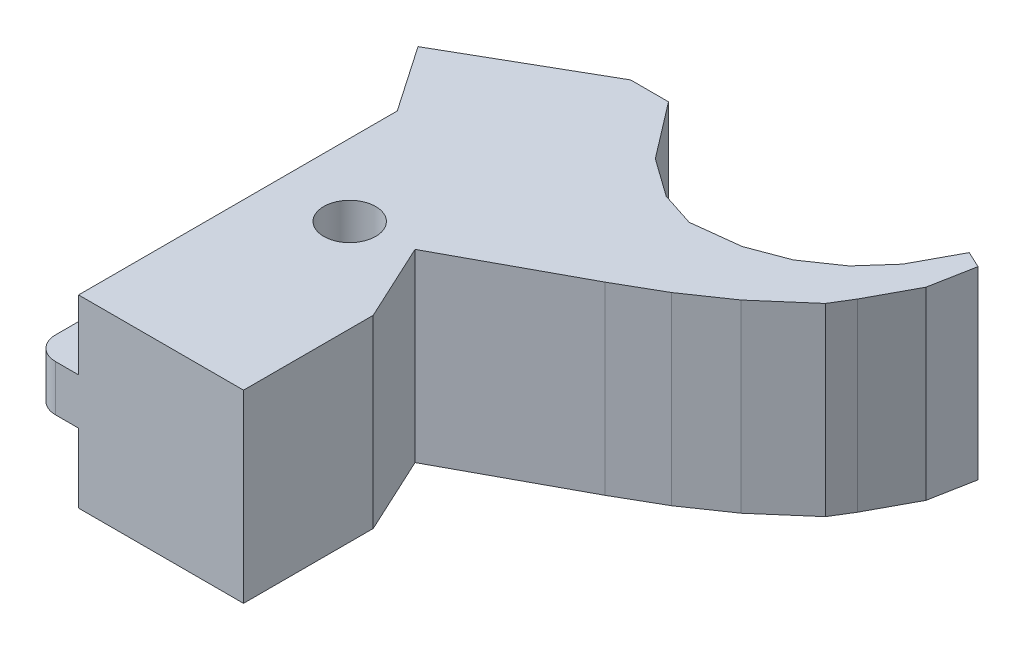
ISO-10303-21;
HEADER;
FILE_DESCRIPTION(('STEP AP214'),'2;1');
FILE_NAME('part.step','',(''),(''),'','','');
FILE_SCHEMA(('AUTOMOTIVE_DESIGN { 1 0 10303 214 1 1 1 1 }'));
ENDSEC;
DATA;
#1=APPLICATION_CONTEXT('core data for automotive mechanical design processes');
#2=APPLICATION_PROTOCOL_DEFINITION('international standard','automotive_design',2000,#1);
#3=PRODUCT_CONTEXT('',#1,'mechanical');
#4=PRODUCT('Part','Part','',(#3));
#5=PRODUCT_RELATED_PRODUCT_CATEGORY('part','',(#4));
#6=PRODUCT_DEFINITION_FORMATION('','',#4);
#7=PRODUCT_DEFINITION_CONTEXT('part definition',#1,'design');
#8=PRODUCT_DEFINITION('design','',#6,#7);
#9=PRODUCT_DEFINITION_SHAPE('','',#8);
#10=(LENGTH_UNIT() NAMED_UNIT(*) SI_UNIT(.MILLI.,.METRE.));
#11=(NAMED_UNIT(*) PLANE_ANGLE_UNIT() SI_UNIT($,.RADIAN.));
#12=(NAMED_UNIT(*) SI_UNIT($,.STERADIAN.) SOLID_ANGLE_UNIT());
#13=UNCERTAINTY_MEASURE_WITH_UNIT(LENGTH_MEASURE(1.E-05),#10,'distance_accuracy_value','');
#14=(GEOMETRIC_REPRESENTATION_CONTEXT(3) GLOBAL_UNCERTAINTY_ASSIGNED_CONTEXT((#13)) GLOBAL_UNIT_ASSIGNED_CONTEXT((#10,
#11,#12)) REPRESENTATION_CONTEXT('',''));
#15=CARTESIAN_POINT('',(0.,0.,0.));
#16=DIRECTION('',(0.,0.,1.));
#17=DIRECTION('',(1.,0.,0.));
#18=AXIS2_PLACEMENT_3D('',#15,#16,#17);
#19=CARTESIAN_POINT('',(-4.,0.,0.));
#20=DIRECTION('',(1.,0.,0.));
#21=DIRECTION('',(0.,0.,-1.));
#22=AXIS2_PLACEMENT_3D('',#19,#20,#21);
#23=PLANE('',#22);
#24=DIRECTION('',(0.,1.,0.));
#25=VECTOR('',#24,1.);
#26=CARTESIAN_POINT('',(-4.,4.00000000000001,-2.));
#27=LINE('',#26,#25);
#28=CARTESIAN_POINT('',(-4.,10.,-2.00000000000001));
#29=VERTEX_POINT('',#28);
#30=CARTESIAN_POINT('',(-4.,6.,-2.00000000000001));
#31=VERTEX_POINT('',#30);
#32=EDGE_CURVE('E41',#29,#31,#27,.F.);
#33=ORIENTED_EDGE('',*,*,#32,.F.);
#34=DIRECTION('',(0.,0.,1.));
#35=VECTOR('',#34,1.);
#36=CARTESIAN_POINT('',(-4.,10.,-8.));
#37=LINE('',#36,#35);
#38=CARTESIAN_POINT('',(-4.,10.,-8.));
#39=VERTEX_POINT('',#38);
#40=EDGE_CURVE('E455',#39,#29,#37,.T.);
#41=ORIENTED_EDGE('',*,*,#40,.F.);
#42=DIRECTION('',(0.,-1.,0.));
#43=VECTOR('',#42,1.);
#44=CARTESIAN_POINT('',(-4.,10.,-8.));
#45=LINE('',#44,#43);
#46=CARTESIAN_POINT('',(-4.,6.,-8.));
#47=VERTEX_POINT('',#46);
#48=EDGE_CURVE('E260',#39,#47,#45,.T.);
#49=ORIENTED_EDGE('',*,*,#48,.T.);
#50=DIRECTION('',(0.,0.,1.));
#51=VECTOR('',#50,1.);
#52=CARTESIAN_POINT('',(-4.,6.,-8.));
#53=LINE('',#52,#51);
#54=EDGE_CURVE('E451',#47,#31,#53,.T.);
#55=ORIENTED_EDGE('',*,*,#54,.T.);
#56=EDGE_LOOP('',(#33,#41,#49,#55));
#57=FACE_BOUND('',#56,.T.);
#58=ADVANCED_FACE('F33',(#57),#23,.F.);
#59=CARTESIAN_POINT('',(0.,16.,0.));
#60=DIRECTION('',(1.,0.,0.));
#61=DIRECTION('',(0.,0.,-1.));
#62=AXIS2_PLACEMENT_3D('',#59,#60,#61);
#63=PLANE('',#62);
#64=DIRECTION('',(0.,0.,1.));
#65=VECTOR('',#64,1.);
#66=CARTESIAN_POINT('',(0.,6.,-8.));
#67=LINE('',#66,#65);
#68=CARTESIAN_POINT('',(0.,6.,-4.45086661432432));
#69=VERTEX_POINT('',#68);
#70=CARTESIAN_POINT('',(0.,6.,0.));
#71=VERTEX_POINT('',#70);
#72=EDGE_CURVE('E460',#69,#71,#67,.T.);
#73=ORIENTED_EDGE('',*,*,#72,.F.);
#74=DIRECTION('',(0.,1.,0.));
#75=VECTOR('',#74,1.);
#76=CARTESIAN_POINT('',(0.,4.00000000000001,-4.45086661432432));
#77=LINE('',#76,#75);
#78=CARTESIAN_POINT('',(0.,10.,-4.45086661432432));
#79=VERTEX_POINT('',#78);
#80=EDGE_CURVE('E453',#69,#79,#77,.T.);
#81=ORIENTED_EDGE('',*,*,#80,.T.);
#82=DIRECTION('',(0.,0.,1.));
#83=VECTOR('',#82,1.);
#84=CARTESIAN_POINT('',(0.,10.,-8.));
#85=LINE('',#84,#83);
#86=CARTESIAN_POINT('',(0.,10.,0.));
#87=VERTEX_POINT('',#86);
#88=EDGE_CURVE('E456',#79,#87,#85,.T.);
#89=ORIENTED_EDGE('',*,*,#88,.T.);
#90=DIRECTION('',(0.,-1.,0.));
#91=VECTOR('',#90,1.);
#92=CARTESIAN_POINT('',(0.,16.,0.));
#93=LINE('',#92,#91);
#94=CARTESIAN_POINT('',(0.,16.,0.));
#95=VERTEX_POINT('',#94);
#96=EDGE_CURVE('E438',#95,#87,#93,.T.);
#97=ORIENTED_EDGE('',*,*,#96,.F.);
#98=DIRECTION('',(0.,0.,1.));
#99=VECTOR('',#98,1.);
#100=CARTESIAN_POINT('',(0.,16.,0.));
#101=LINE('',#100,#99);
#102=CARTESIAN_POINT('',(0.,16.,-27.612650648618));
#103=VERTEX_POINT('',#102);
#104=EDGE_CURVE('E278',#103,#95,#101,.T.);
#105=ORIENTED_EDGE('',*,*,#104,.F.);
#106=DIRECTION('',(0.,-1.,0.));
#107=VECTOR('',#106,1.);
#108=CARTESIAN_POINT('',(0.,16.,-27.612650648618));
#109=LINE('',#108,#107);
#110=CARTESIAN_POINT('',(0.,0.,-27.612650648618));
#111=VERTEX_POINT('',#110);
#112=EDGE_CURVE('E326',#103,#111,#109,.T.);
#113=ORIENTED_EDGE('',*,*,#112,.T.);
#114=DIRECTION('',(0.,0.,1.));
#115=VECTOR('',#114,1.);
#116=CARTESIAN_POINT('',(0.,0.,0.));
#117=LINE('',#116,#115);
#118=CARTESIAN_POINT('',(0.,0.,0.));
#119=VERTEX_POINT('',#118);
#120=EDGE_CURVE('E275',#111,#119,#117,.T.);
#121=ORIENTED_EDGE('',*,*,#120,.T.);
#122=EDGE_CURVE('E437',#71,#119,#93,.T.);
#123=ORIENTED_EDGE('',*,*,#122,.F.);
#124=EDGE_LOOP('',(#73,#81,#89,#97,#105,#113,#121,#123));
#125=FACE_BOUND('',#124,.T.);
#126=ADVANCED_FACE('F35',(#125),#63,.F.);
#127=CARTESIAN_POINT('',(0.,16.,0.));
#128=DIRECTION('',(0.,-1.,0.));
#129=DIRECTION('',(0.,0.,-1.));
#130=AXIS2_PLACEMENT_3D('',#127,#128,#129);
#131=PLANE('',#130);
#132=ORIENTED_EDGE('',*,*,#104,.T.);
#133=DIRECTION('',(1.,0.,0.));
#134=VECTOR('',#133,1.);
#135=CARTESIAN_POINT('',(0.,16.,0.));
#136=LINE('',#135,#134);
#137=CARTESIAN_POINT('',(14.2923466730162,16.,0.));
#138=VERTEX_POINT('',#137);
#139=EDGE_CURVE('E281',#95,#138,#136,.T.);
#140=ORIENTED_EDGE('',*,*,#139,.T.);
#141=DIRECTION('',(0.,0.,-1.));
#142=VECTOR('',#141,1.);
#143=CARTESIAN_POINT('',(14.2923466730162,16.,0.));
#144=LINE('',#143,#142);
#145=CARTESIAN_POINT('',(14.2923466730162,16.,-11.2386097915875));
#146=VERTEX_POINT('',#145);
#147=EDGE_CURVE('E284',#138,#146,#144,.T.);
#148=ORIENTED_EDGE('',*,*,#147,.T.);
#149=DIRECTION('',(-0.421036676412518,0.,-0.907043613678802));
#150=VECTOR('',#149,1.);
#151=CARTESIAN_POINT('',(14.2923466730162,16.,-11.2386097915875));
#152=LINE('',#151,#150);
#153=CARTESIAN_POINT('',(11.156143946173,16.,-17.9949633682485));
#154=VERTEX_POINT('',#153);
#155=EDGE_CURVE('E286',#146,#154,#152,.T.);
#156=ORIENTED_EDGE('',*,*,#155,.T.);
#157=DIRECTION('',(0.879833369481706,0.,-0.475282276070197));
#158=VECTOR('',#157,1.);
#159=CARTESIAN_POINT('',(21.8356423336241,16.,-23.7639833633253));
#160=LINE('',#159,#158);
#161=CARTESIAN_POINT('',(21.8356423336241,16.,-23.7639833633253));
#162=VERTEX_POINT('',#161);
#163=EDGE_CURVE('E288',#154,#162,#160,.T.);
#164=ORIENTED_EDGE('',*,*,#163,.T.);
#165=DIRECTION('',(0.867536104388164,0.,-0.497374212824719));
#166=VECTOR('',#165,1.);
#167=CARTESIAN_POINT('',(25.5178091544874,16.,-25.8750365111453));
#168=LINE('',#167,#166);
#169=CARTESIAN_POINT('',(25.5178091544874,16.,-25.8750365111453));
#170=VERTEX_POINT('',#169);
#171=EDGE_CURVE('E290',#162,#170,#168,.T.);
#172=ORIENTED_EDGE('',*,*,#171,.T.);
#173=DIRECTION('',(0.824555386413117,0.,-0.565781242828989));
#174=VECTOR('',#173,1.);
#175=CARTESIAN_POINT('',(29.0852326361488,16.,-28.3228784929094));
#176=LINE('',#175,#174);
#177=CARTESIAN_POINT('',(29.0852326361488,16.,-28.3228784929094));
#178=VERTEX_POINT('',#177);
#179=EDGE_CURVE('E292',#170,#178,#176,.T.);
#180=ORIENTED_EDGE('',*,*,#179,.T.);
#181=DIRECTION('',(0.755316274404742,0.,-0.655360454726512));
#182=VECTOR('',#181,1.);
#183=CARTESIAN_POINT('',(32.9900829470661,16.,-31.7109750587069));
#184=LINE('',#183,#182);
#185=CARTESIAN_POINT('',(32.9900829470661,16.,-31.7109750587069));
#186=VERTEX_POINT('',#185);
#187=EDGE_CURVE('E294',#178,#186,#184,.T.);
#188=ORIENTED_EDGE('',*,*,#187,.T.);
#189=DIRECTION('',(0.523555652741695,0.,-0.851991477939902));
#190=VECTOR('',#189,1.);
#191=CARTESIAN_POINT('',(34.0491127189331,16.,-33.4343531481045));
#192=LINE('',#191,#190);
#193=CARTESIAN_POINT('',(34.0491127189331,16.,-33.4343531481045));
#194=VERTEX_POINT('',#193);
#195=EDGE_CURVE('E296',#186,#194,#192,.T.);
#196=ORIENTED_EDGE('',*,*,#195,.T.);
#197=DIRECTION('',(0.474087368672936,0.,-0.88047780600352));
#198=VECTOR('',#197,1.);
#199=CARTESIAN_POINT('',(36.1264723932179,16.,-37.2924375628285));
#200=LINE('',#199,#198);
#201=CARTESIAN_POINT('',(36.1264723932179,16.,-37.2924375628285));
#202=VERTEX_POINT('',#201);
#203=EDGE_CURVE('E298',#194,#202,#200,.T.);
#204=ORIENTED_EDGE('',*,*,#203,.T.);
#205=DIRECTION('',(0.185606774758074,0.,-0.982624101660399));
#206=VECTOR('',#205,1.);
#207=CARTESIAN_POINT('',(36.8433222228432,16.,-41.0875248961389));
#208=LINE('',#207,#206);
#209=CARTESIAN_POINT('',(36.8433222228432,16.,-41.0875248961389));
#210=VERTEX_POINT('',#209);
#211=EDGE_CURVE('E300',#202,#210,#208,.T.);
#212=ORIENTED_EDGE('',*,*,#211,.T.);
#213=DIRECTION('',(-0.904818702200994,0.,-0.425797036329879));
#214=VECTOR('',#213,1.);
#215=CARTESIAN_POINT('',(35.4096225635926,16.,-41.7622070887275));
#216=LINE('',#215,#214);
#217=CARTESIAN_POINT('',(35.4096225635926,16.,-41.7622070887275));
#218=VERTEX_POINT('',#217);
#219=EDGE_CURVE('E302',#210,#218,#216,.T.);
#220=ORIENTED_EDGE('',*,*,#219,.T.);
#221=DIRECTION('',(-0.474087368672937,0.,0.880477806003519));
#222=VECTOR('',#221,1.);
#223=CARTESIAN_POINT('',(33.3859189346634,16.,-38.0037729920995));
#224=LINE('',#223,#222);
#225=CARTESIAN_POINT('',(33.3859189346634,16.,-38.0037729920995));
#226=VERTEX_POINT('',#225);
#227=EDGE_CURVE('E304',#218,#226,#224,.T.);
#228=ORIENTED_EDGE('',*,*,#227,.T.);
#229=DIRECTION('',(-0.664736716431069,0.,0.747077705348273));
#230=VECTOR('',#229,1.);
#231=CARTESIAN_POINT('',(31.215394459633,16.,-35.564385481035));
#232=LINE('',#231,#230);
#233=CARTESIAN_POINT('',(31.215394459633,16.,-35.564385481035));
#234=VERTEX_POINT('',#233);
#235=EDGE_CURVE('E306',#226,#234,#232,.T.);
#236=ORIENTED_EDGE('',*,*,#235,.T.);
#237=DIRECTION('',(-0.824555386413117,0.,0.565781242828989));
#238=VECTOR('',#237,1.);
#239=CARTESIAN_POINT('',(28.3448446356475,16.,-33.5947139783334));
#240=LINE('',#239,#238);
#241=CARTESIAN_POINT('',(28.3448446356475,16.,-33.5947139783334));
#242=VERTEX_POINT('',#241);
#243=EDGE_CURVE('E308',#234,#242,#240,.T.);
#244=ORIENTED_EDGE('',*,*,#243,.T.);
#245=DIRECTION('',(-0.936409540785771,0.,0.350909065037342));
#246=VECTOR('',#245,1.);
#247=CARTESIAN_POINT('',(25.1092726517162,16.,-32.3822193482706));
#248=LINE('',#247,#246);
#249=CARTESIAN_POINT('',(25.1092726517162,16.,-32.3822193482706));
#250=VERTEX_POINT('',#249);
#251=EDGE_CURVE('E310',#242,#250,#248,.T.);
#252=ORIENTED_EDGE('',*,*,#251,.T.);
#253=DIRECTION('',(-0.993215047692517,0.,0.116292171005412));
#254=VECTOR('',#253,1.);
#255=CARTESIAN_POINT('',(21.0021220020857,16.,-31.9013270512786));
#256=LINE('',#255,#254);
#257=CARTESIAN_POINT('',(21.0021220020857,16.,-31.9013270512786));
#258=VERTEX_POINT('',#257);
#259=EDGE_CURVE('E312',#250,#258,#256,.T.);
#260=ORIENTED_EDGE('',*,*,#259,.T.);
#261=DIRECTION('',(-0.950748934671646,0.,-0.309962035128062));
#262=VECTOR('',#261,1.);
#263=CARTESIAN_POINT('',(18.052032718616,16.,-32.8631116452625));
#264=LINE('',#263,#262);
#265=CARTESIAN_POINT('',(18.052032718616,16.,-32.8631116452625));
#266=VERTEX_POINT('',#265);
#267=EDGE_CURVE('E314',#258,#266,#264,.T.);
#268=ORIENTED_EDGE('',*,*,#267,.T.);
#269=DIRECTION('',(-0.81435299533713,0.,-0.580369881183925));
#270=VECTOR('',#269,1.);
#271=CARTESIAN_POINT('',(14.7690179987671,16.,-35.2028376287041));
#272=LINE('',#271,#270);
#273=CARTESIAN_POINT('',(14.7690179987671,16.,-35.2028376287041));
#274=VERTEX_POINT('',#273);
#275=EDGE_CURVE('E316',#266,#274,#272,.T.);
#276=ORIENTED_EDGE('',*,*,#275,.T.);
#277=DIRECTION('',(-0.607393028115595,0.,-0.794401478722546));
#278=VECTOR('',#277,1.);
#279=CARTESIAN_POINT('',(11.0636057691116,16.,-40.049098317022));
#280=LINE('',#279,#278);
#281=CARTESIAN_POINT('',(11.0636057691116,16.,-40.049098317022));
#282=VERTEX_POINT('',#281);
#283=EDGE_CURVE('E318',#274,#282,#280,.T.);
#284=ORIENTED_EDGE('',*,*,#283,.T.);
#285=DIRECTION('',(-1.,0.,0.));
#286=VECTOR('',#285,1.);
#287=CARTESIAN_POINT('',(7.77991108283393,16.,-40.049098317022));
#288=LINE('',#287,#286);
#289=CARTESIAN_POINT('',(7.77991108283393,16.,-40.049098317022));
#290=VERTEX_POINT('',#289);
#291=EDGE_CURVE('E320',#282,#290,#288,.T.);
#292=ORIENTED_EDGE('',*,*,#291,.T.);
#293=DIRECTION('',(-0.867536104388164,0.,0.497374212824719));
#294=VECTOR('',#293,1.);
#295=CARTESIAN_POINT('',(-3.92776405159495,16.,-33.336875419854));
#296=LINE('',#295,#294);
#297=CARTESIAN_POINT('',(-3.92776405159495,16.,-33.336875419854));
#298=VERTEX_POINT('',#297);
#299=EDGE_CURVE('E322',#290,#298,#296,.T.);
#300=ORIENTED_EDGE('',*,*,#299,.T.);
#301=DIRECTION('',(0.565781242828988,0.,0.824555386413117));
#302=VECTOR('',#301,1.);
#303=CARTESIAN_POINT('',(0.,16.,-27.612650648618));
#304=LINE('',#303,#302);
#305=EDGE_CURVE('E324',#298,#103,#304,.T.);
#306=ORIENTED_EDGE('',*,*,#305,.T.);
#307=EDGE_LOOP('',(#132,#140,#148,#156,#164,#172,#180,#188,#196,#204,#212,#220,#228,#236,#244,
#252,#260,#268,#276,#284,#292,#300,#306));
#308=FACE_BOUND('',#307,.T.);
#309=CARTESIAN_POINT('',(6.23417854950036,16.,-17.258888852138));
#310=DIRECTION('',(0.,1.,0.));
#311=DIRECTION('',(0.,0.,1.));
#312=AXIS2_PLACEMENT_3D('',#309,#310,#311);
#313=CIRCLE('',#312,2.25);
#314=CARTESIAN_POINT('',(6.23417854950036,16.,-15.008888852138));
#315=VERTEX_POINT('',#314);
#316=EDGE_CURVE('E272',#315,#315,#313,.T.);
#317=ORIENTED_EDGE('',*,*,#316,.F.);
#318=EDGE_LOOP('',(#317));
#319=FACE_BOUND('',#318,.T.);
#320=ADVANCED_FACE('F524',(#308,#319),#131,.F.);
#321=CARTESIAN_POINT('',(0.,0.,0.));
#322=DIRECTION('',(0.,-1.,0.));
#323=DIRECTION('',(0.,0.,-1.));
#324=AXIS2_PLACEMENT_3D('',#321,#322,#323);
#325=PLANE('',#324);
#326=ORIENTED_EDGE('',*,*,#120,.F.);
#327=DIRECTION('',(0.565781242828988,0.,0.824555386413117));
#328=VECTOR('',#327,1.);
#329=CARTESIAN_POINT('',(0.,0.,-27.612650648618));
#330=LINE('',#329,#328);
#331=CARTESIAN_POINT('',(-3.92776405159495,0.,-33.336875419854));
#332=VERTEX_POINT('',#331);
#333=EDGE_CURVE('E282',#332,#111,#330,.T.);
#334=ORIENTED_EDGE('',*,*,#333,.F.);
#335=DIRECTION('',(-0.867536104388164,0.,0.497374212824719));
#336=VECTOR('',#335,1.);
#337=CARTESIAN_POINT('',(-3.92776405159495,0.,-33.336875419854));
#338=LINE('',#337,#336);
#339=CARTESIAN_POINT('',(7.77991108283393,0.,-40.049098317022));
#340=VERTEX_POINT('',#339);
#341=EDGE_CURVE('E369',#340,#332,#338,.T.);
#342=ORIENTED_EDGE('',*,*,#341,.F.);
#343=DIRECTION('',(-1.,0.,0.));
#344=VECTOR('',#343,1.);
#345=CARTESIAN_POINT('',(7.77991108283393,0.,-40.049098317022));
#346=LINE('',#345,#344);
#347=CARTESIAN_POINT('',(11.0636057691116,0.,-40.049098317022));
#348=VERTEX_POINT('',#347);
#349=EDGE_CURVE('E367',#348,#340,#346,.T.);
#350=ORIENTED_EDGE('',*,*,#349,.F.);
#351=DIRECTION('',(-0.607393028115595,0.,-0.794401478722546));
#352=VECTOR('',#351,1.);
#353=CARTESIAN_POINT('',(11.0636057691116,0.,-40.049098317022));
#354=LINE('',#353,#352);
#355=CARTESIAN_POINT('',(14.7690179987671,0.,-35.2028376287041));
#356=VERTEX_POINT('',#355);
#357=EDGE_CURVE('E365',#356,#348,#354,.T.);
#358=ORIENTED_EDGE('',*,*,#357,.F.);
#359=DIRECTION('',(-0.81435299533713,0.,-0.580369881183925));
#360=VECTOR('',#359,1.);
#361=CARTESIAN_POINT('',(14.7690179987671,0.,-35.2028376287041));
#362=LINE('',#361,#360);
#363=CARTESIAN_POINT('',(18.052032718616,0.,-32.8631116452625));
#364=VERTEX_POINT('',#363);
#365=EDGE_CURVE('E363',#364,#356,#362,.T.);
#366=ORIENTED_EDGE('',*,*,#365,.F.);
#367=DIRECTION('',(-0.950748934671646,0.,-0.309962035128062));
#368=VECTOR('',#367,1.);
#369=CARTESIAN_POINT('',(18.052032718616,0.,-32.8631116452625));
#370=LINE('',#369,#368);
#371=CARTESIAN_POINT('',(21.0021220020857,0.,-31.9013270512786));
#372=VERTEX_POINT('',#371);
#373=EDGE_CURVE('E361',#372,#364,#370,.T.);
#374=ORIENTED_EDGE('',*,*,#373,.F.);
#375=DIRECTION('',(-0.993215047692517,0.,0.116292171005412));
#376=VECTOR('',#375,1.);
#377=CARTESIAN_POINT('',(21.0021220020857,0.,-31.9013270512786));
#378=LINE('',#377,#376);
#379=CARTESIAN_POINT('',(25.1092726517162,0.,-32.3822193482706));
#380=VERTEX_POINT('',#379);
#381=EDGE_CURVE('E359',#380,#372,#378,.T.);
#382=ORIENTED_EDGE('',*,*,#381,.F.);
#383=DIRECTION('',(-0.936409540785771,0.,0.350909065037342));
#384=VECTOR('',#383,1.);
#385=CARTESIAN_POINT('',(25.1092726517162,0.,-32.3822193482706));
#386=LINE('',#385,#384);
#387=CARTESIAN_POINT('',(28.3448446356475,0.,-33.5947139783334));
#388=VERTEX_POINT('',#387);
#389=EDGE_CURVE('E357',#388,#380,#386,.T.);
#390=ORIENTED_EDGE('',*,*,#389,.F.);
#391=DIRECTION('',(-0.824555386413117,0.,0.565781242828989));
#392=VECTOR('',#391,1.);
#393=CARTESIAN_POINT('',(28.3448446356475,0.,-33.5947139783334));
#394=LINE('',#393,#392);
#395=CARTESIAN_POINT('',(31.215394459633,0.,-35.564385481035));
#396=VERTEX_POINT('',#395);
#397=EDGE_CURVE('E355',#396,#388,#394,.T.);
#398=ORIENTED_EDGE('',*,*,#397,.F.);
#399=DIRECTION('',(-0.664736716431069,0.,0.747077705348273));
#400=VECTOR('',#399,1.);
#401=CARTESIAN_POINT('',(31.215394459633,0.,-35.564385481035));
#402=LINE('',#401,#400);
#403=CARTESIAN_POINT('',(33.3859189346634,0.,-38.0037729920995));
#404=VERTEX_POINT('',#403);
#405=EDGE_CURVE('E353',#404,#396,#402,.T.);
#406=ORIENTED_EDGE('',*,*,#405,.F.);
#407=DIRECTION('',(-0.474087368672937,0.,0.880477806003519));
#408=VECTOR('',#407,1.);
#409=CARTESIAN_POINT('',(33.3859189346634,0.,-38.0037729920995));
#410=LINE('',#409,#408);
#411=CARTESIAN_POINT('',(35.4096225635926,0.,-41.7622070887275));
#412=VERTEX_POINT('',#411);
#413=EDGE_CURVE('E351',#412,#404,#410,.T.);
#414=ORIENTED_EDGE('',*,*,#413,.F.);
#415=DIRECTION('',(-0.904818702200994,0.,-0.425797036329879));
#416=VECTOR('',#415,1.);
#417=CARTESIAN_POINT('',(35.4096225635926,0.,-41.7622070887275));
#418=LINE('',#417,#416);
#419=CARTESIAN_POINT('',(36.8433222228432,0.,-41.0875248961389));
#420=VERTEX_POINT('',#419);
#421=EDGE_CURVE('E349',#420,#412,#418,.T.);
#422=ORIENTED_EDGE('',*,*,#421,.F.);
#423=DIRECTION('',(0.185606774758074,0.,-0.982624101660399));
#424=VECTOR('',#423,1.);
#425=CARTESIAN_POINT('',(36.8433222228432,0.,-41.0875248961389));
#426=LINE('',#425,#424);
#427=CARTESIAN_POINT('',(36.1264723932179,0.,-37.2924375628285));
#428=VERTEX_POINT('',#427);
#429=EDGE_CURVE('E347',#428,#420,#426,.T.);
#430=ORIENTED_EDGE('',*,*,#429,.F.);
#431=DIRECTION('',(0.474087368672936,0.,-0.88047780600352));
#432=VECTOR('',#431,1.);
#433=CARTESIAN_POINT('',(36.1264723932179,0.,-37.2924375628285));
#434=LINE('',#433,#432);
#435=CARTESIAN_POINT('',(34.0491127189331,0.,-33.4343531481045));
#436=VERTEX_POINT('',#435);
#437=EDGE_CURVE('E345',#436,#428,#434,.T.);
#438=ORIENTED_EDGE('',*,*,#437,.F.);
#439=DIRECTION('',(0.523555652741695,0.,-0.851991477939902));
#440=VECTOR('',#439,1.);
#441=CARTESIAN_POINT('',(34.0491127189331,0.,-33.4343531481045));
#442=LINE('',#441,#440);
#443=CARTESIAN_POINT('',(32.9900829470661,0.,-31.7109750587069));
#444=VERTEX_POINT('',#443);
#445=EDGE_CURVE('E343',#444,#436,#442,.T.);
#446=ORIENTED_EDGE('',*,*,#445,.F.);
#447=DIRECTION('',(0.755316274404742,0.,-0.655360454726512));
#448=VECTOR('',#447,1.);
#449=CARTESIAN_POINT('',(32.9900829470661,0.,-31.7109750587069));
#450=LINE('',#449,#448);
#451=CARTESIAN_POINT('',(29.0852326361488,0.,-28.3228784929094));
#452=VERTEX_POINT('',#451);
#453=EDGE_CURVE('E341',#452,#444,#450,.T.);
#454=ORIENTED_EDGE('',*,*,#453,.F.);
#455=DIRECTION('',(0.824555386413117,0.,-0.565781242828989));
#456=VECTOR('',#455,1.);
#457=CARTESIAN_POINT('',(29.0852326361488,0.,-28.3228784929094));
#458=LINE('',#457,#456);
#459=CARTESIAN_POINT('',(25.5178091544874,0.,-25.8750365111453));
#460=VERTEX_POINT('',#459);
#461=EDGE_CURVE('E339',#460,#452,#458,.T.);
#462=ORIENTED_EDGE('',*,*,#461,.F.);
#463=DIRECTION('',(0.867536104388164,0.,-0.497374212824719));
#464=VECTOR('',#463,1.);
#465=CARTESIAN_POINT('',(25.5178091544874,0.,-25.8750365111453));
#466=LINE('',#465,#464);
#467=CARTESIAN_POINT('',(21.8356423336241,0.,-23.7639833633253));
#468=VERTEX_POINT('',#467);
#469=EDGE_CURVE('E337',#468,#460,#466,.T.);
#470=ORIENTED_EDGE('',*,*,#469,.F.);
#471=DIRECTION('',(0.879833369481706,0.,-0.475282276070197));
#472=VECTOR('',#471,1.);
#473=CARTESIAN_POINT('',(21.8356423336241,0.,-23.7639833633253));
#474=LINE('',#473,#472);
#475=CARTESIAN_POINT('',(11.156143946173,0.,-17.9949633682485));
#476=VERTEX_POINT('',#475);
#477=EDGE_CURVE('E335',#476,#468,#474,.T.);
#478=ORIENTED_EDGE('',*,*,#477,.F.);
#479=DIRECTION('',(-0.421036676412518,0.,-0.907043613678802));
#480=VECTOR('',#479,1.);
#481=CARTESIAN_POINT('',(14.2923466730162,0.,-11.2386097915875));
#482=LINE('',#481,#480);
#483=CARTESIAN_POINT('',(14.2923466730162,0.,-11.2386097915875));
#484=VERTEX_POINT('',#483);
#485=EDGE_CURVE('E333',#484,#476,#482,.T.);
#486=ORIENTED_EDGE('',*,*,#485,.F.);
#487=DIRECTION('',(0.,0.,-1.));
#488=VECTOR('',#487,1.);
#489=CARTESIAN_POINT('',(14.2923466730162,0.,0.));
#490=LINE('',#489,#488);
#491=CARTESIAN_POINT('',(14.2923466730162,0.,0.));
#492=VERTEX_POINT('',#491);
#493=EDGE_CURVE('E331',#492,#484,#490,.T.);
#494=ORIENTED_EDGE('',*,*,#493,.F.);
#495=DIRECTION('',(1.,0.,0.));
#496=VECTOR('',#495,1.);
#497=CARTESIAN_POINT('',(0.,0.,0.));
#498=LINE('',#497,#496);
#499=EDGE_CURVE('E329',#119,#492,#498,.T.);
#500=ORIENTED_EDGE('',*,*,#499,.F.);
#501=EDGE_LOOP('',(#326,#334,#342,#350,#358,#366,#374,#382,#390,#398,#406,#414,#422,#430,#438,
#446,#454,#462,#470,#478,#486,#494,#500));
#502=FACE_BOUND('',#501,.T.);
#503=CARTESIAN_POINT('',(6.23417854950036,0.,-17.258888852138));
#504=DIRECTION('',(0.,1.,0.));
#505=DIRECTION('',(0.,0.,1.));
#506=AXIS2_PLACEMENT_3D('',#503,#504,#505);
#507=CIRCLE('',#506,2.25);
#508=CARTESIAN_POINT('',(6.23417854950036,0.,-15.008888852138));
#509=VERTEX_POINT('',#508);
#510=EDGE_CURVE('E271',#509,#509,#507,.T.);
#511=ORIENTED_EDGE('',*,*,#510,.T.);
#512=EDGE_LOOP('',(#511));
#513=FACE_BOUND('',#512,.T.);
#514=ADVANCED_FACE('F509',(#502,#513),#325,.T.);
#515=CARTESIAN_POINT('',(0.,16.,0.));
#516=DIRECTION('',(0.,0.,-1.));
#517=DIRECTION('',(-1.,0.,0.));
#518=AXIS2_PLACEMENT_3D('',#515,#516,#517);
#519=PLANE('',#518);
#520=DIRECTION('',(1.,0.,0.));
#521=VECTOR('',#520,1.);
#522=CARTESIAN_POINT('',(-4.,10.,0.));
#523=LINE('',#522,#521);
#524=CARTESIAN_POINT('',(-1.99999999999999,10.,0.));
#525=VERTEX_POINT('',#524);
#526=EDGE_CURVE('E262',#525,#87,#523,.T.);
#527=ORIENTED_EDGE('',*,*,#526,.F.);
#528=DIRECTION('',(0.,1.,0.));
#529=VECTOR('',#528,1.);
#530=CARTESIAN_POINT('',(-1.99999999999999,4.00000000000001,0.));
#531=LINE('',#530,#529);
#532=CARTESIAN_POINT('',(-1.99999999999999,6.,0.));
#533=VERTEX_POINT('',#532);
#534=EDGE_CURVE('E257',#533,#525,#531,.T.);
#535=ORIENTED_EDGE('',*,*,#534,.F.);
#536=DIRECTION('',(1.,0.,0.));
#537=VECTOR('',#536,1.);
#538=CARTESIAN_POINT('',(-4.,6.,0.));
#539=LINE('',#538,#537);
#540=EDGE_CURVE('E265',#533,#71,#539,.T.);
#541=ORIENTED_EDGE('',*,*,#540,.T.);
#542=ORIENTED_EDGE('',*,*,#122,.T.);
#543=ORIENTED_EDGE('',*,*,#499,.T.);
#544=DIRECTION('',(0.,-1.,0.));
#545=VECTOR('',#544,1.);
#546=CARTESIAN_POINT('',(14.2923466730162,16.,0.));
#547=LINE('',#546,#545);
#548=EDGE_CURVE('E434',#138,#492,#547,.T.);
#549=ORIENTED_EDGE('',*,*,#548,.F.);
#550=ORIENTED_EDGE('',*,*,#139,.F.);
#551=ORIENTED_EDGE('',*,*,#96,.T.);
#552=EDGE_LOOP('',(#527,#535,#541,#542,#543,#549,#550,#551));
#553=FACE_BOUND('',#552,.T.);
#554=ADVANCED_FACE('F505',(#553),#519,.F.);
#555=CARTESIAN_POINT('',(14.2923466730162,16.,0.));
#556=DIRECTION('',(-1.,0.,0.));
#557=DIRECTION('',(0.,0.,1.));
#558=AXIS2_PLACEMENT_3D('',#555,#556,#557);
#559=PLANE('',#558);
#560=ORIENTED_EDGE('',*,*,#493,.T.);
#561=DIRECTION('',(0.,-1.,0.));
#562=VECTOR('',#561,1.);
#563=CARTESIAN_POINT('',(14.2923466730162,16.,-11.2386097915875));
#564=LINE('',#563,#562);
#565=EDGE_CURVE('E431',#146,#484,#564,.T.);
#566=ORIENTED_EDGE('',*,*,#565,.F.);
#567=ORIENTED_EDGE('',*,*,#147,.F.);
#568=ORIENTED_EDGE('',*,*,#548,.T.);
#569=EDGE_LOOP('',(#560,#566,#567,#568));
#570=FACE_BOUND('',#569,.T.);
#571=ADVANCED_FACE('F516',(#570),#559,.F.);
#572=CARTESIAN_POINT('',(14.2923466730162,16.,-11.2386097915875));
#573=DIRECTION('',(-0.907043613678802,0.,0.421036676412518));
#574=DIRECTION('',(0.421036676412518,0.,0.907043613678802));
#575=AXIS2_PLACEMENT_3D('',#572,#573,#574);
#576=PLANE('',#575);
#577=ORIENTED_EDGE('',*,*,#485,.T.);
#578=DIRECTION('',(0.,-1.,0.));
#579=VECTOR('',#578,1.);
#580=CARTESIAN_POINT('',(11.156143946173,16.,-17.9949633682485));
#581=LINE('',#580,#579);
#582=EDGE_CURVE('E428',#154,#476,#581,.T.);
#583=ORIENTED_EDGE('',*,*,#582,.F.);
#584=ORIENTED_EDGE('',*,*,#155,.F.);
#585=ORIENTED_EDGE('',*,*,#565,.T.);
#586=EDGE_LOOP('',(#577,#583,#584,#585));
#587=FACE_BOUND('',#586,.T.);
#588=ADVANCED_FACE('F520',(#587),#576,.F.);
#589=CARTESIAN_POINT('',(21.8356423336241,16.,-23.7639833633253));
#590=DIRECTION('',(-0.475282276070197,0.,-0.879833369481706));
#591=DIRECTION('',(-0.879833369481706,0.,0.475282276070197));
#592=AXIS2_PLACEMENT_3D('',#589,#590,#591);
#593=PLANE('',#592);
#594=ORIENTED_EDGE('',*,*,#477,.T.);
#595=DIRECTION('',(0.,-1.,0.));
#596=VECTOR('',#595,1.);
#597=CARTESIAN_POINT('',(21.8356423336241,16.,-23.7639833633253));
#598=LINE('',#597,#596);
#599=EDGE_CURVE('E425',#162,#468,#598,.T.);
#600=ORIENTED_EDGE('',*,*,#599,.F.);
#601=ORIENTED_EDGE('',*,*,#163,.F.);
#602=ORIENTED_EDGE('',*,*,#582,.T.);
#603=EDGE_LOOP('',(#594,#600,#601,#602));
#604=FACE_BOUND('',#603,.T.);
#605=ADVANCED_FACE('F618',(#604),#593,.F.);
#606=CARTESIAN_POINT('',(25.5178091544874,16.,-25.8750365111453));
#607=DIRECTION('',(-0.497374212824719,0.,-0.867536104388164));
#608=DIRECTION('',(-0.867536104388164,0.,0.497374212824719));
#609=AXIS2_PLACEMENT_3D('',#606,#607,#608);
#610=PLANE('',#609);
#611=ORIENTED_EDGE('',*,*,#469,.T.);
#612=DIRECTION('',(0.,-1.,0.));
#613=VECTOR('',#612,1.);
#614=CARTESIAN_POINT('',(25.5178091544874,16.,-25.8750365111453));
#615=LINE('',#614,#613);
#616=EDGE_CURVE('E422',#170,#460,#615,.T.);
#617=ORIENTED_EDGE('',*,*,#616,.F.);
#618=ORIENTED_EDGE('',*,*,#171,.F.);
#619=ORIENTED_EDGE('',*,*,#599,.T.);
#620=EDGE_LOOP('',(#611,#617,#618,#619));
#621=FACE_BOUND('',#620,.T.);
#622=ADVANCED_FACE('F616',(#621),#610,.F.);
#623=CARTESIAN_POINT('',(29.0852326361488,16.,-28.3228784929094));
#624=DIRECTION('',(-0.565781242828989,0.,-0.824555386413117));
#625=DIRECTION('',(-0.824555386413117,0.,0.565781242828989));
#626=AXIS2_PLACEMENT_3D('',#623,#624,#625);
#627=PLANE('',#626);
#628=ORIENTED_EDGE('',*,*,#461,.T.);
#629=DIRECTION('',(0.,-1.,0.));
#630=VECTOR('',#629,1.);
#631=CARTESIAN_POINT('',(29.0852326361488,16.,-28.3228784929094));
#632=LINE('',#631,#630);
#633=EDGE_CURVE('E419',#178,#452,#632,.T.);
#634=ORIENTED_EDGE('',*,*,#633,.F.);
#635=ORIENTED_EDGE('',*,*,#179,.F.);
#636=ORIENTED_EDGE('',*,*,#616,.T.);
#637=EDGE_LOOP('',(#628,#634,#635,#636));
#638=FACE_BOUND('',#637,.T.);
#639=ADVANCED_FACE('F611',(#638),#627,.F.);
#640=CARTESIAN_POINT('',(32.9900829470661,16.,-31.7109750587069));
#641=DIRECTION('',(-0.655360454726512,0.,-0.755316274404742));
#642=DIRECTION('',(-0.755316274404742,0.,0.655360454726512));
#643=AXIS2_PLACEMENT_3D('',#640,#641,#642);
#644=PLANE('',#643);
#645=ORIENTED_EDGE('',*,*,#453,.T.);
#646=DIRECTION('',(0.,-1.,0.));
#647=VECTOR('',#646,1.);
#648=CARTESIAN_POINT('',(32.9900829470661,16.,-31.7109750587069));
#649=LINE('',#648,#647);
#650=EDGE_CURVE('E416',#186,#444,#649,.T.);
#651=ORIENTED_EDGE('',*,*,#650,.F.);
#652=ORIENTED_EDGE('',*,*,#187,.F.);
#653=ORIENTED_EDGE('',*,*,#633,.T.);
#654=EDGE_LOOP('',(#645,#651,#652,#653));
#655=FACE_BOUND('',#654,.T.);
#656=ADVANCED_FACE('F606',(#655),#644,.F.);
#657=CARTESIAN_POINT('',(34.0491127189331,16.,-33.4343531481045));
#658=DIRECTION('',(-0.851991477939902,0.,-0.523555652741695));
#659=DIRECTION('',(-0.523555652741695,0.,0.851991477939902));
#660=AXIS2_PLACEMENT_3D('',#657,#658,#659);
#661=PLANE('',#660);
#662=ORIENTED_EDGE('',*,*,#445,.T.);
#663=DIRECTION('',(0.,-1.,0.));
#664=VECTOR('',#663,1.);
#665=CARTESIAN_POINT('',(34.0491127189331,16.,-33.4343531481045));
#666=LINE('',#665,#664);
#667=EDGE_CURVE('E413',#194,#436,#666,.T.);
#668=ORIENTED_EDGE('',*,*,#667,.F.);
#669=ORIENTED_EDGE('',*,*,#195,.F.);
#670=ORIENTED_EDGE('',*,*,#650,.T.);
#671=EDGE_LOOP('',(#662,#668,#669,#670));
#672=FACE_BOUND('',#671,.T.);
#673=ADVANCED_FACE('F602',(#672),#661,.F.);
#674=CARTESIAN_POINT('',(36.1264723932179,16.,-37.2924375628285));
#675=DIRECTION('',(-0.88047780600352,0.,-0.474087368672936));
#676=DIRECTION('',(-0.474087368672936,0.,0.88047780600352));
#677=AXIS2_PLACEMENT_3D('',#674,#675,#676);
#678=PLANE('',#677);
#679=ORIENTED_EDGE('',*,*,#437,.T.);
#680=DIRECTION('',(0.,-1.,0.));
#681=VECTOR('',#680,1.);
#682=CARTESIAN_POINT('',(36.1264723932179,16.,-37.2924375628285));
#683=LINE('',#682,#681);
#684=EDGE_CURVE('E410',#202,#428,#683,.T.);
#685=ORIENTED_EDGE('',*,*,#684,.F.);
#686=ORIENTED_EDGE('',*,*,#203,.F.);
#687=ORIENTED_EDGE('',*,*,#667,.T.);
#688=EDGE_LOOP('',(#679,#685,#686,#687));
#689=FACE_BOUND('',#688,.T.);
#690=ADVANCED_FACE('F597',(#689),#678,.F.);
#691=CARTESIAN_POINT('',(36.8433222228432,16.,-41.0875248961389));
#692=DIRECTION('',(-0.982624101660399,0.,-0.185606774758074));
#693=DIRECTION('',(-0.185606774758074,0.,0.982624101660399));
#694=AXIS2_PLACEMENT_3D('',#691,#692,#693);
#695=PLANE('',#694);
#696=ORIENTED_EDGE('',*,*,#429,.T.);
#697=DIRECTION('',(0.,-1.,0.));
#698=VECTOR('',#697,1.);
#699=CARTESIAN_POINT('',(36.8433222228432,16.,-41.0875248961389));
#700=LINE('',#699,#698);
#701=EDGE_CURVE('E407',#210,#420,#700,.T.);
#702=ORIENTED_EDGE('',*,*,#701,.F.);
#703=ORIENTED_EDGE('',*,*,#211,.F.);
#704=ORIENTED_EDGE('',*,*,#684,.T.);
#705=EDGE_LOOP('',(#696,#702,#703,#704));
#706=FACE_BOUND('',#705,.T.);
#707=ADVANCED_FACE('F591',(#706),#695,.F.);
#708=CARTESIAN_POINT('',(35.4096225635926,16.,-41.7622070887275));
#709=DIRECTION('',(-0.425797036329879,0.,0.904818702200994));
#710=DIRECTION('',(0.904818702200994,0.,0.425797036329879));
#711=AXIS2_PLACEMENT_3D('',#708,#709,#710);
#712=PLANE('',#711);
#713=ORIENTED_EDGE('',*,*,#421,.T.);
#714=DIRECTION('',(0.,-1.,0.));
#715=VECTOR('',#714,1.);
#716=CARTESIAN_POINT('',(35.4096225635926,16.,-41.7622070887275));
#717=LINE('',#716,#715);
#718=EDGE_CURVE('E404',#218,#412,#717,.T.);
#719=ORIENTED_EDGE('',*,*,#718,.F.);
#720=ORIENTED_EDGE('',*,*,#219,.F.);
#721=ORIENTED_EDGE('',*,*,#701,.T.);
#722=EDGE_LOOP('',(#713,#719,#720,#721));
#723=FACE_BOUND('',#722,.T.);
#724=ADVANCED_FACE('F587',(#723),#712,.F.);
#725=CARTESIAN_POINT('',(33.3859189346634,16.,-38.0037729920995));
#726=DIRECTION('',(0.880477806003519,0.,0.474087368672937));
#727=DIRECTION('',(0.474087368672937,0.,-0.880477806003519));
#728=AXIS2_PLACEMENT_3D('',#725,#726,#727);
#729=PLANE('',#728);
#730=ORIENTED_EDGE('',*,*,#413,.T.);
#731=DIRECTION('',(0.,-1.,0.));
#732=VECTOR('',#731,1.);
#733=CARTESIAN_POINT('',(33.3859189346634,16.,-38.0037729920995));
#734=LINE('',#733,#732);
#735=EDGE_CURVE('E401',#226,#404,#734,.T.);
#736=ORIENTED_EDGE('',*,*,#735,.F.);
#737=ORIENTED_EDGE('',*,*,#227,.F.);
#738=ORIENTED_EDGE('',*,*,#718,.T.);
#739=EDGE_LOOP('',(#730,#736,#737,#738));
#740=FACE_BOUND('',#739,.T.);
#741=ADVANCED_FACE('F582',(#740),#729,.F.);
#742=CARTESIAN_POINT('',(31.215394459633,16.,-35.564385481035));
#743=DIRECTION('',(0.747077705348273,0.,0.664736716431069));
#744=DIRECTION('',(0.664736716431069,0.,-0.747077705348273));
#745=AXIS2_PLACEMENT_3D('',#742,#743,#744);
#746=PLANE('',#745);
#747=ORIENTED_EDGE('',*,*,#405,.T.);
#748=DIRECTION('',(0.,-1.,0.));
#749=VECTOR('',#748,1.);
#750=CARTESIAN_POINT('',(31.215394459633,16.,-35.564385481035));
#751=LINE('',#750,#749);
#752=EDGE_CURVE('E398',#234,#396,#751,.T.);
#753=ORIENTED_EDGE('',*,*,#752,.F.);
#754=ORIENTED_EDGE('',*,*,#235,.F.);
#755=ORIENTED_EDGE('',*,*,#735,.T.);
#756=EDGE_LOOP('',(#747,#753,#754,#755));
#757=FACE_BOUND('',#756,.T.);
#758=ADVANCED_FACE('F576',(#757),#746,.F.);
#759=CARTESIAN_POINT('',(28.3448446356475,16.,-33.5947139783334));
#760=DIRECTION('',(0.565781242828989,0.,0.824555386413117));
#761=DIRECTION('',(0.824555386413117,0.,-0.565781242828989));
#762=AXIS2_PLACEMENT_3D('',#759,#760,#761);
#763=PLANE('',#762);
#764=ORIENTED_EDGE('',*,*,#397,.T.);
#765=DIRECTION('',(0.,-1.,0.));
#766=VECTOR('',#765,1.);
#767=CARTESIAN_POINT('',(28.3448446356475,16.,-33.5947139783334));
#768=LINE('',#767,#766);
#769=EDGE_CURVE('E395',#242,#388,#768,.T.);
#770=ORIENTED_EDGE('',*,*,#769,.F.);
#771=ORIENTED_EDGE('',*,*,#243,.F.);
#772=ORIENTED_EDGE('',*,*,#752,.T.);
#773=EDGE_LOOP('',(#764,#770,#771,#772));
#774=FACE_BOUND('',#773,.T.);
#775=ADVANCED_FACE('F572',(#774),#763,.F.);
#776=CARTESIAN_POINT('',(25.1092726517162,16.,-32.3822193482706));
#777=DIRECTION('',(0.350909065037342,0.,0.936409540785771));
#778=DIRECTION('',(0.936409540785771,0.,-0.350909065037342));
#779=AXIS2_PLACEMENT_3D('',#776,#777,#778);
#780=PLANE('',#779);
#781=ORIENTED_EDGE('',*,*,#389,.T.);
#782=DIRECTION('',(0.,-1.,0.));
#783=VECTOR('',#782,1.);
#784=CARTESIAN_POINT('',(25.1092726517162,16.,-32.3822193482706));
#785=LINE('',#784,#783);
#786=EDGE_CURVE('E392',#250,#380,#785,.T.);
#787=ORIENTED_EDGE('',*,*,#786,.F.);
#788=ORIENTED_EDGE('',*,*,#251,.F.);
#789=ORIENTED_EDGE('',*,*,#769,.T.);
#790=EDGE_LOOP('',(#781,#787,#788,#789));
#791=FACE_BOUND('',#790,.T.);
#792=ADVANCED_FACE('F567',(#791),#780,.F.);
#793=CARTESIAN_POINT('',(21.0021220020857,16.,-31.9013270512786));
#794=DIRECTION('',(0.116292171005412,0.,0.993215047692517));
#795=DIRECTION('',(0.993215047692517,0.,-0.116292171005412));
#796=AXIS2_PLACEMENT_3D('',#793,#794,#795);
#797=PLANE('',#796);
#798=ORIENTED_EDGE('',*,*,#381,.T.);
#799=DIRECTION('',(0.,-1.,0.));
#800=VECTOR('',#799,1.);
#801=CARTESIAN_POINT('',(21.0021220020857,16.,-31.9013270512786));
#802=LINE('',#801,#800);
#803=EDGE_CURVE('E389',#258,#372,#802,.T.);
#804=ORIENTED_EDGE('',*,*,#803,.F.);
#805=ORIENTED_EDGE('',*,*,#259,.F.);
#806=ORIENTED_EDGE('',*,*,#786,.T.);
#807=EDGE_LOOP('',(#798,#804,#805,#806));
#808=FACE_BOUND('',#807,.T.);
#809=ADVANCED_FACE('F561',(#808),#797,.F.);
#810=CARTESIAN_POINT('',(18.052032718616,16.,-32.8631116452625));
#811=DIRECTION('',(-0.309962035128062,0.,0.950748934671646));
#812=DIRECTION('',(0.950748934671646,0.,0.309962035128062));
#813=AXIS2_PLACEMENT_3D('',#810,#811,#812);
#814=PLANE('',#813);
#815=ORIENTED_EDGE('',*,*,#373,.T.);
#816=DIRECTION('',(0.,-1.,0.));
#817=VECTOR('',#816,1.);
#818=CARTESIAN_POINT('',(18.052032718616,16.,-32.8631116452625));
#819=LINE('',#818,#817);
#820=EDGE_CURVE('E386',#266,#364,#819,.T.);
#821=ORIENTED_EDGE('',*,*,#820,.F.);
#822=ORIENTED_EDGE('',*,*,#267,.F.);
#823=ORIENTED_EDGE('',*,*,#803,.T.);
#824=EDGE_LOOP('',(#815,#821,#822,#823));
#825=FACE_BOUND('',#824,.T.);
#826=ADVANCED_FACE('F557',(#825),#814,.F.);
#827=CARTESIAN_POINT('',(14.7690179987671,16.,-35.2028376287041));
#828=DIRECTION('',(-0.580369881183925,0.,0.814352995337131));
#829=DIRECTION('',(0.814352995337131,0.,0.580369881183925));
#830=AXIS2_PLACEMENT_3D('',#827,#828,#829);
#831=PLANE('',#830);
#832=ORIENTED_EDGE('',*,*,#365,.T.);
#833=DIRECTION('',(0.,-1.,0.));
#834=VECTOR('',#833,1.);
#835=CARTESIAN_POINT('',(14.7690179987671,16.,-35.2028376287041));
#836=LINE('',#835,#834);
#837=EDGE_CURVE('E383',#274,#356,#836,.T.);
#838=ORIENTED_EDGE('',*,*,#837,.F.);
#839=ORIENTED_EDGE('',*,*,#275,.F.);
#840=ORIENTED_EDGE('',*,*,#820,.T.);
#841=EDGE_LOOP('',(#832,#838,#839,#840));
#842=FACE_BOUND('',#841,.T.);
#843=ADVANCED_FACE('F552',(#842),#831,.F.);
#844=CARTESIAN_POINT('',(11.0636057691116,16.,-40.049098317022));
#845=DIRECTION('',(-0.794401478722546,0.,0.607393028115595));
#846=DIRECTION('',(0.607393028115595,0.,0.794401478722546));
#847=AXIS2_PLACEMENT_3D('',#844,#845,#846);
#848=PLANE('',#847);
#849=ORIENTED_EDGE('',*,*,#357,.T.);
#850=DIRECTION('',(0.,-1.,0.));
#851=VECTOR('',#850,1.);
#852=CARTESIAN_POINT('',(11.0636057691116,16.,-40.049098317022));
#853=LINE('',#852,#851);
#854=EDGE_CURVE('E380',#282,#348,#853,.T.);
#855=ORIENTED_EDGE('',*,*,#854,.F.);
#856=ORIENTED_EDGE('',*,*,#283,.F.);
#857=ORIENTED_EDGE('',*,*,#837,.T.);
#858=EDGE_LOOP('',(#849,#855,#856,#857));
#859=FACE_BOUND('',#858,.T.);
#860=ADVANCED_FACE('F546',(#859),#848,.F.);
#861=CARTESIAN_POINT('',(7.77991108283393,16.,-40.049098317022));
#862=DIRECTION('',(0.,0.,1.));
#863=DIRECTION('',(1.,0.,0.));
#864=AXIS2_PLACEMENT_3D('',#861,#862,#863);
#865=PLANE('',#864);
#866=ORIENTED_EDGE('',*,*,#349,.T.);
#867=DIRECTION('',(0.,-1.,0.));
#868=VECTOR('',#867,1.);
#869=CARTESIAN_POINT('',(7.77991108283393,16.,-40.049098317022));
#870=LINE('',#869,#868);
#871=EDGE_CURVE('E377',#290,#340,#870,.T.);
#872=ORIENTED_EDGE('',*,*,#871,.F.);
#873=ORIENTED_EDGE('',*,*,#291,.F.);
#874=ORIENTED_EDGE('',*,*,#854,.T.);
#875=EDGE_LOOP('',(#866,#872,#873,#874));
#876=FACE_BOUND('',#875,.T.);
#877=ADVANCED_FACE('F542',(#876),#865,.F.);
#878=CARTESIAN_POINT('',(-3.92776405159495,16.,-33.336875419854));
#879=DIRECTION('',(0.497374212824719,0.,0.867536104388164));
#880=DIRECTION('',(0.867536104388164,0.,-0.497374212824719));
#881=AXIS2_PLACEMENT_3D('',#878,#879,#880);
#882=PLANE('',#881);
#883=ORIENTED_EDGE('',*,*,#341,.T.);
#884=DIRECTION('',(0.,-1.,0.));
#885=VECTOR('',#884,1.);
#886=CARTESIAN_POINT('',(-3.92776405159495,16.,-33.336875419854));
#887=LINE('',#886,#885);
#888=EDGE_CURVE('E374',#298,#332,#887,.T.);
#889=ORIENTED_EDGE('',*,*,#888,.F.);
#890=ORIENTED_EDGE('',*,*,#299,.F.);
#891=ORIENTED_EDGE('',*,*,#871,.T.);
#892=EDGE_LOOP('',(#883,#889,#890,#891));
#893=FACE_BOUND('',#892,.T.);
#894=ADVANCED_FACE('F537',(#893),#882,.F.);
#895=CARTESIAN_POINT('',(0.,16.,-27.612650648618));
#896=DIRECTION('',(0.824555386413117,0.,-0.565781242828988));
#897=DIRECTION('',(-0.565781242828988,0.,-0.824555386413117));
#898=AXIS2_PLACEMENT_3D('',#895,#896,#897);
#899=PLANE('',#898);
#900=ORIENTED_EDGE('',*,*,#333,.T.);
#901=ORIENTED_EDGE('',*,*,#112,.F.);
#902=ORIENTED_EDGE('',*,*,#305,.F.);
#903=ORIENTED_EDGE('',*,*,#888,.T.);
#904=EDGE_LOOP('',(#900,#901,#902,#903));
#905=FACE_BOUND('',#904,.T.);
#906=ADVANCED_FACE('F531',(#905),#899,.F.);
#907=CARTESIAN_POINT('',(6.23417854950036,16.,-17.258888852138));
#908=DIRECTION('',(0.,-1.,0.));
#909=DIRECTION('',(0.,0.,-1.));
#910=AXIS2_PLACEMENT_3D('',#907,#908,#909);
#911=CYLINDRICAL_SURFACE('',#910,2.25);
#912=ORIENTED_EDGE('',*,*,#316,.T.);
#913=EDGE_LOOP('',(#912));
#914=FACE_BOUND('',#913,.T.);
#915=ORIENTED_EDGE('',*,*,#510,.F.);
#916=EDGE_LOOP('',(#915));
#917=FACE_BOUND('',#916,.T.);
#918=ADVANCED_FACE('F641',(#914,#917),#911,.F.);
#919=CARTESIAN_POINT('',(-4.,6.,-8.));
#920=DIRECTION('',(0.,1.,0.));
#921=DIRECTION('',(0.,0.,1.));
#922=AXIS2_PLACEMENT_3D('',#919,#920,#921);
#923=PLANE('',#922);
#924=DIRECTION('',(1.,0.,0.));
#925=VECTOR('',#924,1.);
#926=CARTESIAN_POINT('',(-4.,6.,-3.95086661432432));
#927=LINE('',#926,#925);
#928=CARTESIAN_POINT('',(-1.5,6.,-3.95086661432432));
#929=VERTEX_POINT('',#928);
#930=CARTESIAN_POINT('',(-0.500000000000003,6.,-3.95086661432432));
#931=VERTEX_POINT('',#930);
#932=EDGE_CURVE('E469',#929,#931,#927,.T.);
#933=ORIENTED_EDGE('',*,*,#932,.T.);
#934=CARTESIAN_POINT('',(-0.5,6.,-4.45086661432432));
#935=DIRECTION('',(0.,1.,0.));
#936=DIRECTION('',(0.,0.,1.));
#937=AXIS2_PLACEMENT_3D('',#934,#935,#936);
#938=CIRCLE('',#937,0.5);
#939=EDGE_CURVE('E462',#931,#69,#938,.T.);
#940=ORIENTED_EDGE('',*,*,#939,.T.);
#941=ORIENTED_EDGE('',*,*,#72,.T.);
#942=ORIENTED_EDGE('',*,*,#540,.F.);
#943=CARTESIAN_POINT('',(-2.,6.,-2.));
#944=DIRECTION('',(0.,1.,0.));
#945=DIRECTION('',(0.,0.,1.));
#946=AXIS2_PLACEMENT_3D('',#943,#944,#945);
#947=CIRCLE('',#946,2.);
#948=EDGE_CURVE('E442',#533,#31,#947,.F.);
#949=ORIENTED_EDGE('',*,*,#948,.T.);
#950=ORIENTED_EDGE('',*,*,#54,.F.);
#951=DIRECTION('',(1.,0.,0.));
#952=VECTOR('',#951,1.);
#953=CARTESIAN_POINT('',(-4.,6.,-8.));
#954=LINE('',#953,#952);
#955=CARTESIAN_POINT('',(-2.,6.,-8.));
#956=VERTEX_POINT('',#955);
#957=EDGE_CURVE('E263',#47,#956,#954,.T.);
#958=ORIENTED_EDGE('',*,*,#957,.T.);
#959=DIRECTION('',(0.,0.,1.));
#960=VECTOR('',#959,1.);
#961=CARTESIAN_POINT('',(-2.,6.,-8.));
#962=LINE('',#961,#960);
#963=CARTESIAN_POINT('',(-2.,6.,-4.45086661432432));
#964=VERTEX_POINT('',#963);
#965=EDGE_CURVE('E48',#956,#964,#962,.T.);
#966=ORIENTED_EDGE('',*,*,#965,.T.);
#967=CARTESIAN_POINT('',(-1.5,6.,-4.45086661432432));
#968=DIRECTION('',(0.,1.,0.));
#969=DIRECTION('',(0.,0.,1.));
#970=AXIS2_PLACEMENT_3D('',#967,#968,#969);
#971=CIRCLE('',#970,0.5);
#972=EDGE_CURVE('E470',#964,#929,#971,.T.);
#973=ORIENTED_EDGE('',*,*,#972,.T.);
#974=EDGE_LOOP('',(#933,#940,#941,#942,#949,#950,#958,#966,#973));
#975=FACE_BOUND('',#974,.T.);
#976=ADVANCED_FACE('F450',(#975),#923,.F.);
#977=CARTESIAN_POINT('',(-4.,10.,-8.));
#978=DIRECTION('',(0.,1.,0.));
#979=DIRECTION('',(0.,0.,1.));
#980=AXIS2_PLACEMENT_3D('',#977,#978,#979);
#981=PLANE('',#980);
#982=CARTESIAN_POINT('',(-0.5,10.,-4.45086661432432));
#983=DIRECTION('',(0.,1.,0.));
#984=DIRECTION('',(0.,0.,-1.));
#985=AXIS2_PLACEMENT_3D('',#982,#983,#984);
#986=CIRCLE('',#985,0.5);
#987=CARTESIAN_POINT('',(-0.500000000000003,10.,-3.95086661432432));
#988=VERTEX_POINT('',#987);
#989=EDGE_CURVE('E480',#988,#79,#986,.T.);
#990=ORIENTED_EDGE('',*,*,#989,.F.);
#991=DIRECTION('',(1.,0.,0.));
#992=VECTOR('',#991,1.);
#993=CARTESIAN_POINT('',(-1.5,10.,-3.95086661432432));
#994=LINE('',#993,#992);
#995=CARTESIAN_POINT('',(-1.5,10.,-3.95086661432432));
#996=VERTEX_POINT('',#995);
#997=EDGE_CURVE('E487',#996,#988,#994,.T.);
#998=ORIENTED_EDGE('',*,*,#997,.F.);
#999=CARTESIAN_POINT('',(-1.5,10.,-4.45086661432432));
#1000=DIRECTION('',(0.,1.,0.));
#1001=DIRECTION('',(0.,0.,-1.));
#1002=AXIS2_PLACEMENT_3D('',#999,#1000,#1001);
#1003=CIRCLE('',#1002,0.5);
#1004=CARTESIAN_POINT('',(-2.,10.,-4.45086661432432));
#1005=VERTEX_POINT('',#1004);
#1006=EDGE_CURVE('E256',#1005,#996,#1003,.T.);
#1007=ORIENTED_EDGE('',*,*,#1006,.F.);
#1008=DIRECTION('',(0.,0.,1.));
#1009=VECTOR('',#1008,1.);
#1010=CARTESIAN_POINT('',(-2.,10.,-8.));
#1011=LINE('',#1010,#1009);
#1012=CARTESIAN_POINT('',(-2.,10.,-8.));
#1013=VERTEX_POINT('',#1012);
#1014=EDGE_CURVE('E242',#1013,#1005,#1011,.T.);
#1015=ORIENTED_EDGE('',*,*,#1014,.F.);
#1016=DIRECTION('',(1.,0.,0.));
#1017=VECTOR('',#1016,1.);
#1018=CARTESIAN_POINT('',(-4.,10.,-8.));
#1019=LINE('',#1018,#1017);
#1020=EDGE_CURVE('E252',#39,#1013,#1019,.T.);
#1021=ORIENTED_EDGE('',*,*,#1020,.F.);
#1022=ORIENTED_EDGE('',*,*,#40,.T.);
#1023=CARTESIAN_POINT('',(-2.,10.,-2.));
#1024=DIRECTION('',(0.,-1.,0.));
#1025=DIRECTION('',(0.,0.,1.));
#1026=AXIS2_PLACEMENT_3D('',#1023,#1024,#1025);
#1027=CIRCLE('',#1026,2.);
#1028=EDGE_CURVE('E55',#525,#29,#1027,.T.);
#1029=ORIENTED_EDGE('',*,*,#1028,.F.);
#1030=ORIENTED_EDGE('',*,*,#526,.T.);
#1031=ORIENTED_EDGE('',*,*,#88,.F.);
#1032=EDGE_LOOP('',(#990,#998,#1007,#1015,#1021,#1022,#1029,#1030,#1031));
#1033=FACE_BOUND('',#1032,.T.);
#1034=ADVANCED_FACE('F250',(#1033),#981,.T.);
#1035=CARTESIAN_POINT('',(-4.,10.,-8.));
#1036=DIRECTION('',(0.,0.,1.));
#1037=DIRECTION('',(1.,0.,0.));
#1038=AXIS2_PLACEMENT_3D('',#1035,#1036,#1037);
#1039=PLANE('',#1038);
#1040=ORIENTED_EDGE('',*,*,#1020,.T.);
#1041=DIRECTION('',(0.,-1.,0.));
#1042=VECTOR('',#1041,1.);
#1043=CARTESIAN_POINT('',(-2.,10.,-8.));
#1044=LINE('',#1043,#1042);
#1045=EDGE_CURVE('E11',#1013,#956,#1044,.T.);
#1046=ORIENTED_EDGE('',*,*,#1045,.T.);
#1047=ORIENTED_EDGE('',*,*,#957,.F.);
#1048=ORIENTED_EDGE('',*,*,#48,.F.);
#1049=EDGE_LOOP('',(#1040,#1046,#1047,#1048));
#1050=FACE_BOUND('',#1049,.T.);
#1051=ADVANCED_FACE('F259',(#1050),#1039,.F.);
#1052=CARTESIAN_POINT('',(-2.,4.00000000000001,-2.));
#1053=DIRECTION('',(0.,1.,0.));
#1054=DIRECTION('',(0.,0.,1.));
#1055=AXIS2_PLACEMENT_3D('',#1052,#1053,#1054);
#1056=CYLINDRICAL_SURFACE('',#1055,2.);
#1057=ORIENTED_EDGE('',*,*,#534,.T.);
#1058=ORIENTED_EDGE('',*,*,#1028,.T.);
#1059=ORIENTED_EDGE('',*,*,#32,.T.);
#1060=ORIENTED_EDGE('',*,*,#948,.F.);
#1061=EDGE_LOOP('',(#1057,#1058,#1059,#1060));
#1062=FACE_BOUND('',#1061,.T.);
#1063=ADVANCED_FACE('F441',(#1062),#1056,.T.);
#1064=CARTESIAN_POINT('',(-0.5,4.00000000000001,-4.45086661432432));
#1065=DIRECTION('',(0.,1.,0.));
#1066=DIRECTION('',(0.,0.,1.));
#1067=AXIS2_PLACEMENT_3D('',#1064,#1065,#1066);
#1068=CYLINDRICAL_SURFACE('',#1067,0.5);
#1069=DIRECTION('',(0.,1.,0.));
#1070=VECTOR('',#1069,1.);
#1071=CARTESIAN_POINT('',(-0.500000000000003,4.00000000000001,-3.95086661432432));
#1072=LINE('',#1071,#1070);
#1073=EDGE_CURVE('E482',#931,#988,#1072,.T.);
#1074=ORIENTED_EDGE('',*,*,#1073,.T.);
#1075=ORIENTED_EDGE('',*,*,#989,.T.);
#1076=ORIENTED_EDGE('',*,*,#80,.F.);
#1077=ORIENTED_EDGE('',*,*,#939,.F.);
#1078=EDGE_LOOP('',(#1074,#1075,#1076,#1077));
#1079=FACE_BOUND('',#1078,.T.);
#1080=ADVANCED_FACE('F498',(#1079),#1068,.F.);
#1081=CARTESIAN_POINT('',(-1.5,4.00000000000001,-3.95086661432432));
#1082=DIRECTION('',(0.,0.,1.));
#1083=DIRECTION('',(1.,0.,0.));
#1084=AXIS2_PLACEMENT_3D('',#1081,#1082,#1083);
#1085=PLANE('',#1084);
#1086=DIRECTION('',(0.,1.,0.));
#1087=VECTOR('',#1086,1.);
#1088=CARTESIAN_POINT('',(-1.5,4.00000000000001,-3.95086661432432));
#1089=LINE('',#1088,#1087);
#1090=EDGE_CURVE('E479',#929,#996,#1089,.T.);
#1091=ORIENTED_EDGE('',*,*,#1090,.T.);
#1092=ORIENTED_EDGE('',*,*,#997,.T.);
#1093=ORIENTED_EDGE('',*,*,#1073,.F.);
#1094=ORIENTED_EDGE('',*,*,#932,.F.);
#1095=EDGE_LOOP('',(#1091,#1092,#1093,#1094));
#1096=FACE_BOUND('',#1095,.T.);
#1097=ADVANCED_FACE('F496',(#1096),#1085,.F.);
#1098=CARTESIAN_POINT('',(-1.5,4.00000000000001,-4.45086661432432));
#1099=DIRECTION('',(0.,1.,0.));
#1100=DIRECTION('',(0.,0.,1.));
#1101=AXIS2_PLACEMENT_3D('',#1098,#1099,#1100);
#1102=CYLINDRICAL_SURFACE('',#1101,0.5);
#1103=DIRECTION('',(0.,1.,0.));
#1104=VECTOR('',#1103,1.);
#1105=CARTESIAN_POINT('',(-2.,4.00000000000001,-4.45086661432432));
#1106=LINE('',#1105,#1104);
#1107=EDGE_CURVE('E477',#964,#1005,#1106,.T.);
#1108=ORIENTED_EDGE('',*,*,#1107,.T.);
#1109=ORIENTED_EDGE('',*,*,#1006,.T.);
#1110=ORIENTED_EDGE('',*,*,#1090,.F.);
#1111=ORIENTED_EDGE('',*,*,#972,.F.);
#1112=EDGE_LOOP('',(#1108,#1109,#1110,#1111));
#1113=FACE_BOUND('',#1112,.T.);
#1114=ADVANCED_FACE('F492',(#1113),#1102,.F.);
#1115=CARTESIAN_POINT('',(-2.,4.00000000000001,-8.));
#1116=DIRECTION('',(-1.,0.,0.));
#1117=DIRECTION('',(0.,0.,1.));
#1118=AXIS2_PLACEMENT_3D('',#1115,#1116,#1117);
#1119=PLANE('',#1118);
#1120=ORIENTED_EDGE('',*,*,#1045,.F.);
#1121=ORIENTED_EDGE('',*,*,#1014,.T.);
#1122=ORIENTED_EDGE('',*,*,#1107,.F.);
#1123=ORIENTED_EDGE('',*,*,#965,.F.);
#1124=EDGE_LOOP('',(#1120,#1121,#1122,#1123));
#1125=FACE_BOUND('',#1124,.T.);
#1126=ADVANCED_FACE('F241',(#1125),#1119,.F.);
#1127=CLOSED_SHELL('',(#58,#126,#320,#514,#554,#571,#588,#605,#622,#639,#656,#673,#690,#707,
#724,#741,#758,#775,#792,#809,#826,#843,#860,#877,#894,#906,#918,#976,#1034,#1051,#1063,#1080,
#1097,#1114,#1126));
#1128=MANIFOLD_SOLID_BREP('B2',#1127);
#1129=ADVANCED_BREP_SHAPE_REPRESENTATION('',(#18,#1128),#14);
#1130=SHAPE_DEFINITION_REPRESENTATION(#9,#1129);
ENDSEC;
END-ISO-10303-21;
